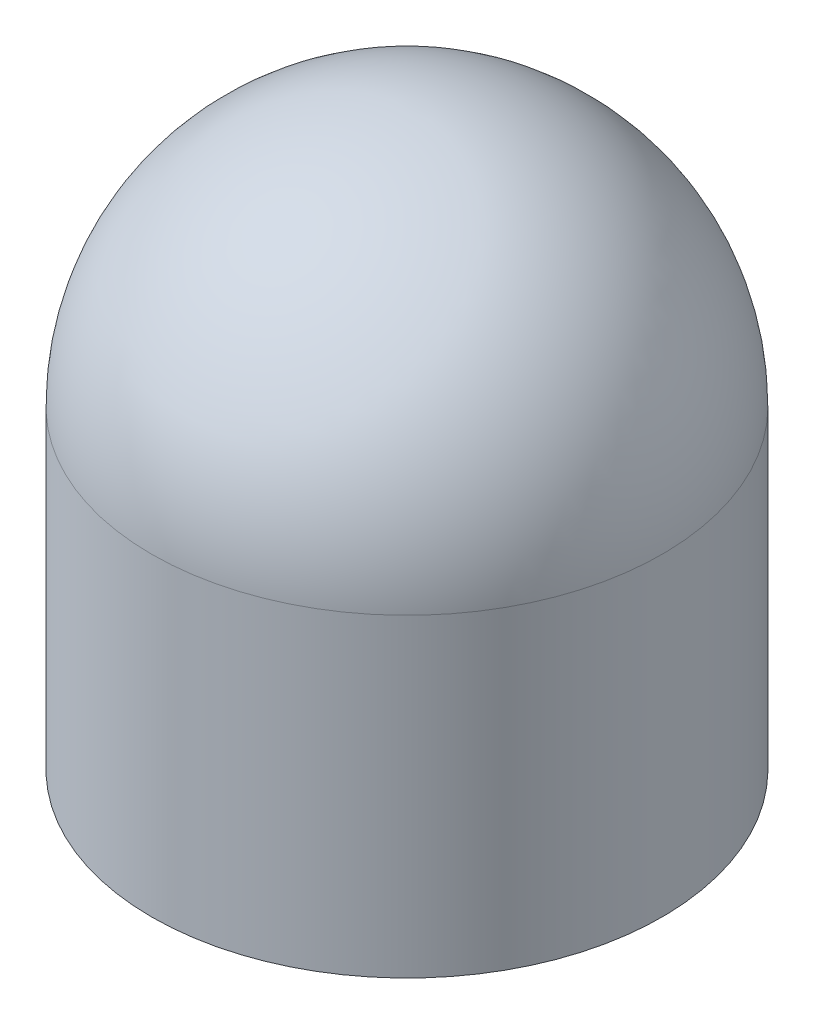
ISO-10303-21;
HEADER;
FILE_DESCRIPTION(('STEP AP214'),'2;1');
FILE_NAME('part.step','',(''),(''),'','','');
FILE_SCHEMA(('AUTOMOTIVE_DESIGN { 1 0 10303 214 1 1 1 1 }'));
ENDSEC;
DATA;
#1=APPLICATION_CONTEXT('core data for automotive mechanical design processes');
#2=APPLICATION_PROTOCOL_DEFINITION('international standard','automotive_design',2000,#1);
#3=PRODUCT_CONTEXT('',#1,'mechanical');
#4=PRODUCT('Part','Part','',(#3));
#5=PRODUCT_RELATED_PRODUCT_CATEGORY('part','',(#4));
#6=PRODUCT_DEFINITION_FORMATION('','',#4);
#7=PRODUCT_DEFINITION_CONTEXT('part definition',#1,'design');
#8=PRODUCT_DEFINITION('design','',#6,#7);
#9=PRODUCT_DEFINITION_SHAPE('','',#8);
#10=(LENGTH_UNIT() NAMED_UNIT(*) SI_UNIT(.MILLI.,.METRE.));
#11=(NAMED_UNIT(*) PLANE_ANGLE_UNIT() SI_UNIT($,.RADIAN.));
#12=(NAMED_UNIT(*) SI_UNIT($,.STERADIAN.) SOLID_ANGLE_UNIT());
#13=UNCERTAINTY_MEASURE_WITH_UNIT(LENGTH_MEASURE(1.E-05),#10,'distance_accuracy_value','');
#14=(GEOMETRIC_REPRESENTATION_CONTEXT(3) GLOBAL_UNCERTAINTY_ASSIGNED_CONTEXT((#13)) GLOBAL_UNIT_ASSIGNED_CONTEXT((#10,
#11,#12)) REPRESENTATION_CONTEXT('',''));
#15=CARTESIAN_POINT('',(0.,0.,0.));
#16=DIRECTION('',(0.,0.,1.));
#17=DIRECTION('',(1.,0.,0.));
#18=AXIS2_PLACEMENT_3D('',#15,#16,#17);
#19=CARTESIAN_POINT('',(0.,203.2,0.));
#20=DIRECTION('',(0.,-1.,0.));
#21=DIRECTION('',(0.,0.,-1.));
#22=AXIS2_PLACEMENT_3D('',#19,#20,#21);
#23=CYLINDRICAL_SURFACE('',#22,165.1);
#24=CARTESIAN_POINT('',(0.,203.2,0.));
#25=DIRECTION('',(0.,1.,0.));
#26=DIRECTION('',(0.,0.,1.));
#27=AXIS2_PLACEMENT_3D('',#24,#25,#26);
#28=CIRCLE('',#27,165.1);
#29=CARTESIAN_POINT('',(0.,203.2,165.1));
#30=VERTEX_POINT('',#29);
#31=EDGE_CURVE('E10',#30,#30,#28,.T.);
#32=ORIENTED_EDGE('',*,*,#31,.F.);
#33=EDGE_LOOP('',(#32));
#34=FACE_BOUND('',#33,.T.);
#35=CARTESIAN_POINT('',(0.,0.,0.));
#36=DIRECTION('',(0.,1.,0.));
#37=DIRECTION('',(0.,0.,1.));
#38=AXIS2_PLACEMENT_3D('',#35,#36,#37);
#39=CIRCLE('',#38,165.1);
#40=CARTESIAN_POINT('',(0.,0.,165.1));
#41=VERTEX_POINT('',#40);
#42=EDGE_CURVE('E34',#41,#41,#39,.T.);
#43=ORIENTED_EDGE('',*,*,#42,.T.);
#44=EDGE_LOOP('',(#43));
#45=FACE_BOUND('',#44,.T.);
#46=ADVANCED_FACE('F31',(#34,#45),#23,.T.);
#47=CARTESIAN_POINT('',(0.,0.,0.));
#48=DIRECTION('',(0.,1.,0.));
#49=DIRECTION('',(0.,0.,1.));
#50=AXIS2_PLACEMENT_3D('',#47,#48,#49);
#51=PLANE('',#50);
#52=CARTESIAN_POINT('',(0.,0.,0.));
#53=DIRECTION('',(0.,1.,0.));
#54=DIRECTION('',(0.,0.,1.));
#55=AXIS2_PLACEMENT_3D('',#52,#53,#54);
#56=CIRCLE('',#55,162.56);
#57=CARTESIAN_POINT('',(0.,0.,162.56));
#58=VERTEX_POINT('',#57);
#59=EDGE_CURVE('E43',#58,#58,#56,.T.);
#60=ORIENTED_EDGE('',*,*,#59,.T.);
#61=EDGE_LOOP('',(#60));
#62=FACE_BOUND('',#61,.T.);
#63=ORIENTED_EDGE('',*,*,#42,.F.);
#64=EDGE_LOOP('',(#63));
#65=FACE_BOUND('',#64,.T.);
#66=ADVANCED_FACE('F62',(#62,#65),#51,.F.);
#67=CARTESIAN_POINT('',(0.,203.2,0.));
#68=DIRECTION('',(0.,0.,-1.));
#69=DIRECTION('',(-1.,0.,0.));
#70=AXIS2_PLACEMENT_3D('',#67,#68,#69);
#71=SPHERICAL_SURFACE('',#70,165.1);
#72=CARTESIAN_POINT('',(0.,203.2,0.));
#73=DIRECTION('',(0.,1.,0.));
#74=DIRECTION('',(0.,0.,1.));
#75=AXIS2_PLACEMENT_3D('',#72,#73,#74);
#76=SPHERICAL_SURFACE('',#75,165.1);
#77=ORIENTED_EDGE('',*,*,#31,.T.);
#78=EDGE_LOOP('',(#77));
#79=FACE_BOUND('',#78,.T.);
#80=ADVANCED_FACE('F58',(#79),#76,.T.);
#81=CARTESIAN_POINT('',(0.,203.2,0.));
#82=DIRECTION('',(0.,-1.,0.));
#83=DIRECTION('',(0.,0.,-1.));
#84=AXIS2_PLACEMENT_3D('',#81,#82,#83);
#85=CYLINDRICAL_SURFACE('',#84,162.56);
#86=CARTESIAN_POINT('',(0.,203.2,0.));
#87=DIRECTION('',(0.,-1.,0.));
#88=DIRECTION('',(0.,0.,-1.));
#89=AXIS2_PLACEMENT_3D('',#86,#87,#88);
#90=CIRCLE('',#89,162.56);
#91=CARTESIAN_POINT('',(0.,203.2,-162.56));
#92=VERTEX_POINT('',#91);
#93=EDGE_CURVE('E41',#92,#92,#90,.F.);
#94=ORIENTED_EDGE('',*,*,#93,.T.);
#95=EDGE_LOOP('',(#94));
#96=FACE_BOUND('',#95,.T.);
#97=ORIENTED_EDGE('',*,*,#59,.F.);
#98=EDGE_LOOP('',(#97));
#99=FACE_BOUND('',#98,.T.);
#100=ADVANCED_FACE('F49',(#96,#99),#85,.F.);
#101=CARTESIAN_POINT('',(0.,203.2,0.));
#102=DIRECTION('',(0.,0.,-1.));
#103=DIRECTION('',(-1.,0.,0.));
#104=AXIS2_PLACEMENT_3D('',#101,#102,#103);
#105=SPHERICAL_SURFACE('',#104,162.56);
#106=CARTESIAN_POINT('',(0.,203.2,0.));
#107=DIRECTION('',(0.,-1.,0.));
#108=DIRECTION('',(0.,0.,-1.));
#109=AXIS2_PLACEMENT_3D('',#106,#107,#108);
#110=SPHERICAL_SURFACE('',#109,162.56);
#111=ORIENTED_EDGE('',*,*,#93,.F.);
#112=EDGE_LOOP('',(#111));
#113=FACE_BOUND('',#112,.T.);
#114=ADVANCED_FACE('F52',(#113),#110,.F.);
#115=CLOSED_SHELL('',(#46,#66,#80,#100,#114));
#116=MANIFOLD_SOLID_BREP('B2',#115);
#117=ADVANCED_BREP_SHAPE_REPRESENTATION('',(#18,#116),#14);
#118=SHAPE_DEFINITION_REPRESENTATION(#9,#117);
ENDSEC;
END-ISO-10303-21;
